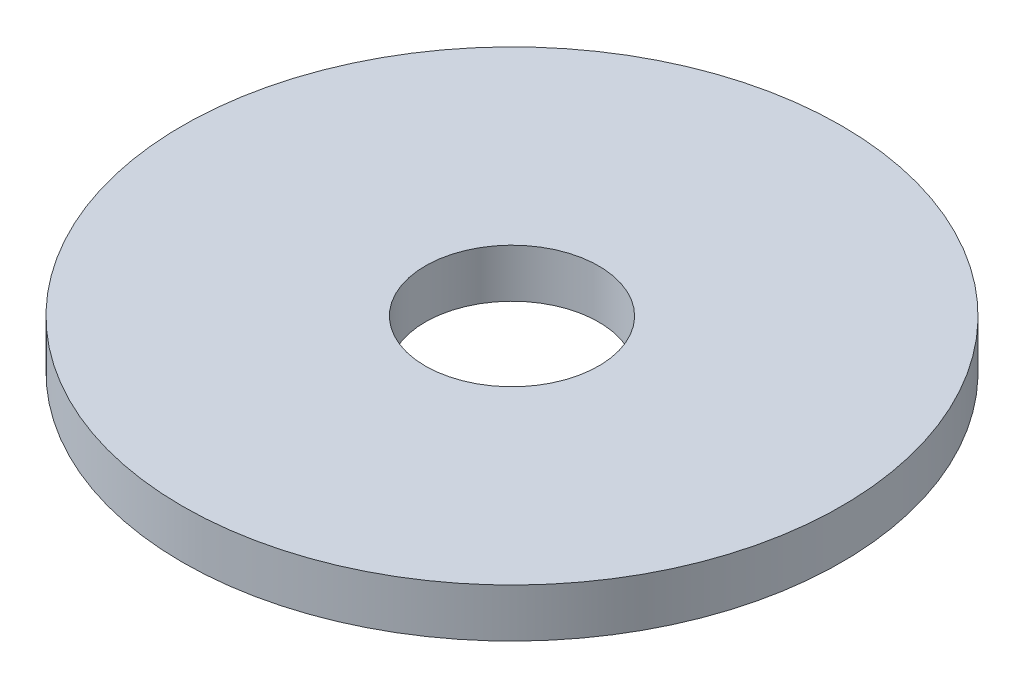
ISO-10303-21;
HEADER;
FILE_DESCRIPTION(('STEP AP214'),'2;1');
FILE_NAME('part.step','',(''),(''),'','','');
FILE_SCHEMA(('AUTOMOTIVE_DESIGN { 1 0 10303 214 1 1 1 1 }'));
ENDSEC;
DATA;
#1=APPLICATION_CONTEXT('core data for automotive mechanical design processes');
#2=APPLICATION_PROTOCOL_DEFINITION('international standard','automotive_design',2000,#1);
#3=PRODUCT_CONTEXT('',#1,'mechanical');
#4=PRODUCT('Part','Part','',(#3));
#5=PRODUCT_RELATED_PRODUCT_CATEGORY('part','',(#4));
#6=PRODUCT_DEFINITION_FORMATION('','',#4);
#7=PRODUCT_DEFINITION_CONTEXT('part definition',#1,'design');
#8=PRODUCT_DEFINITION('design','',#6,#7);
#9=PRODUCT_DEFINITION_SHAPE('','',#8);
#10=(LENGTH_UNIT() NAMED_UNIT(*) SI_UNIT(.MILLI.,.METRE.));
#11=(NAMED_UNIT(*) PLANE_ANGLE_UNIT() SI_UNIT($,.RADIAN.));
#12=(NAMED_UNIT(*) SI_UNIT($,.STERADIAN.) SOLID_ANGLE_UNIT());
#13=UNCERTAINTY_MEASURE_WITH_UNIT(LENGTH_MEASURE(1.E-05),#10,'distance_accuracy_value','');
#14=(GEOMETRIC_REPRESENTATION_CONTEXT(3) GLOBAL_UNCERTAINTY_ASSIGNED_CONTEXT((#13)) GLOBAL_UNIT_ASSIGNED_CONTEXT((#10,
#11,#12)) REPRESENTATION_CONTEXT('',''));
#15=CARTESIAN_POINT('',(0.,0.,0.));
#16=DIRECTION('',(0.,0.,1.));
#17=DIRECTION('',(1.,0.,0.));
#18=AXIS2_PLACEMENT_3D('',#15,#16,#17);
#19=CARTESIAN_POINT('',(0.,14.,0.));
#20=DIRECTION('',(0.,-1.,0.));
#21=DIRECTION('',(0.,0.,-1.));
#22=AXIS2_PLACEMENT_3D('',#19,#20,#21);
#23=CYLINDRICAL_SURFACE('',#22,95.);
#24=CARTESIAN_POINT('',(0.,14.,0.));
#25=DIRECTION('',(0.,1.,0.));
#26=DIRECTION('',(0.,0.,1.));
#27=AXIS2_PLACEMENT_3D('',#24,#25,#26);
#28=CIRCLE('',#27,95.);
#29=CARTESIAN_POINT('',(0.,14.,95.));
#30=VERTEX_POINT('',#29);
#31=EDGE_CURVE('E10',#30,#30,#28,.T.);
#32=ORIENTED_EDGE('',*,*,#31,.F.);
#33=EDGE_LOOP('',(#32));
#34=FACE_BOUND('',#33,.T.);
#35=CARTESIAN_POINT('',(0.,0.,0.));
#36=DIRECTION('',(0.,1.,0.));
#37=DIRECTION('',(0.,0.,1.));
#38=AXIS2_PLACEMENT_3D('',#35,#36,#37);
#39=CIRCLE('',#38,95.);
#40=CARTESIAN_POINT('',(0.,0.,95.));
#41=VERTEX_POINT('',#40);
#42=EDGE_CURVE('E37',#41,#41,#39,.T.);
#43=ORIENTED_EDGE('',*,*,#42,.T.);
#44=EDGE_LOOP('',(#43));
#45=FACE_BOUND('',#44,.T.);
#46=ADVANCED_FACE('F40',(#34,#45),#23,.T.);
#47=CARTESIAN_POINT('',(0.,14.,0.));
#48=DIRECTION('',(0.,1.,0.));
#49=DIRECTION('',(0.,0.,1.));
#50=AXIS2_PLACEMENT_3D('',#47,#48,#49);
#51=PLANE('',#50);
#52=CARTESIAN_POINT('',(0.,14.,0.));
#53=DIRECTION('',(0.,1.,0.));
#54=DIRECTION('',(0.,0.,1.));
#55=AXIS2_PLACEMENT_3D('',#52,#53,#54);
#56=CIRCLE('',#55,25.);
#57=CARTESIAN_POINT('',(0.,14.,25.));
#58=VERTEX_POINT('',#57);
#59=EDGE_CURVE('E50',#58,#58,#56,.T.);
#60=ORIENTED_EDGE('',*,*,#59,.F.);
#61=EDGE_LOOP('',(#60));
#62=FACE_BOUND('',#61,.T.);
#63=ORIENTED_EDGE('',*,*,#31,.T.);
#64=EDGE_LOOP('',(#63));
#65=FACE_BOUND('',#64,.T.);
#66=ADVANCED_FACE('F59',(#62,#65),#51,.T.);
#67=CARTESIAN_POINT('',(0.,0.,0.));
#68=DIRECTION('',(0.,1.,0.));
#69=DIRECTION('',(0.,0.,1.));
#70=AXIS2_PLACEMENT_3D('',#67,#68,#69);
#71=PLANE('',#70);
#72=CARTESIAN_POINT('',(0.,0.,0.));
#73=DIRECTION('',(0.,1.,0.));
#74=DIRECTION('',(0.,0.,1.));
#75=AXIS2_PLACEMENT_3D('',#72,#73,#74);
#76=CIRCLE('',#75,25.);
#77=CARTESIAN_POINT('',(0.,0.,25.));
#78=VERTEX_POINT('',#77);
#79=EDGE_CURVE('E47',#78,#78,#76,.T.);
#80=ORIENTED_EDGE('',*,*,#79,.T.);
#81=EDGE_LOOP('',(#80));
#82=FACE_BOUND('',#81,.T.);
#83=ORIENTED_EDGE('',*,*,#42,.F.);
#84=EDGE_LOOP('',(#83));
#85=FACE_BOUND('',#84,.T.);
#86=ADVANCED_FACE('F58',(#82,#85),#71,.F.);
#87=CARTESIAN_POINT('',(0.,14.,0.));
#88=DIRECTION('',(0.,-1.,0.));
#89=DIRECTION('',(0.,0.,-1.));
#90=AXIS2_PLACEMENT_3D('',#87,#88,#89);
#91=CYLINDRICAL_SURFACE('',#90,25.);
#92=ORIENTED_EDGE('',*,*,#59,.T.);
#93=EDGE_LOOP('',(#92));
#94=FACE_BOUND('',#93,.T.);
#95=ORIENTED_EDGE('',*,*,#79,.F.);
#96=EDGE_LOOP('',(#95));
#97=FACE_BOUND('',#96,.T.);
#98=ADVANCED_FACE('F54',(#94,#97),#91,.F.);
#99=CLOSED_SHELL('',(#46,#66,#86,#98));
#100=MANIFOLD_SOLID_BREP('B2',#99);
#101=ADVANCED_BREP_SHAPE_REPRESENTATION('',(#18,#100),#14);
#102=SHAPE_DEFINITION_REPRESENTATION(#9,#101);
ENDSEC;
END-ISO-10303-21;
